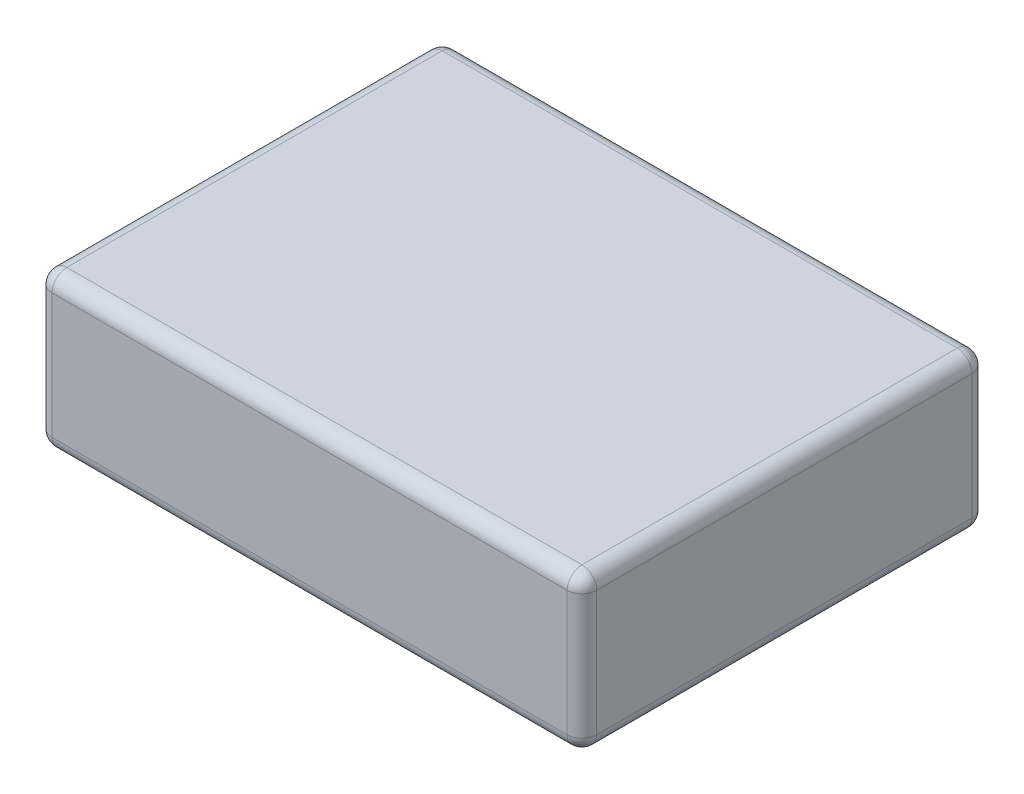
ISO-10303-21;
HEADER;
FILE_DESCRIPTION(('STEP AP214'),'2;1');
FILE_NAME('part.step','',(''),(''),'','','');
FILE_SCHEMA(('AUTOMOTIVE_DESIGN { 1 0 10303 214 1 1 1 1 }'));
ENDSEC;
DATA;
#1=APPLICATION_CONTEXT('core data for automotive mechanical design processes');
#2=APPLICATION_PROTOCOL_DEFINITION('international standard','automotive_design',2000,#1);
#3=PRODUCT_CONTEXT('',#1,'mechanical');
#4=PRODUCT('Part','Part','',(#3));
#5=PRODUCT_RELATED_PRODUCT_CATEGORY('part','',(#4));
#6=PRODUCT_DEFINITION_FORMATION('','',#4);
#7=PRODUCT_DEFINITION_CONTEXT('part definition',#1,'design');
#8=PRODUCT_DEFINITION('design','',#6,#7);
#9=PRODUCT_DEFINITION_SHAPE('','',#8);
#10=(LENGTH_UNIT() NAMED_UNIT(*) SI_UNIT(.MILLI.,.METRE.));
#11=(NAMED_UNIT(*) PLANE_ANGLE_UNIT() SI_UNIT($,.RADIAN.));
#12=(NAMED_UNIT(*) SI_UNIT($,.STERADIAN.) SOLID_ANGLE_UNIT());
#13=UNCERTAINTY_MEASURE_WITH_UNIT(LENGTH_MEASURE(1.E-05),#10,'distance_accuracy_value','');
#14=(GEOMETRIC_REPRESENTATION_CONTEXT(3) GLOBAL_UNCERTAINTY_ASSIGNED_CONTEXT((#13)) GLOBAL_UNIT_ASSIGNED_CONTEXT((#10,
#11,#12)) REPRESENTATION_CONTEXT('',''));
#15=CARTESIAN_POINT('',(0.,0.,0.));
#16=DIRECTION('',(0.,0.,1.));
#17=DIRECTION('',(1.,0.,0.));
#18=AXIS2_PLACEMENT_3D('',#15,#16,#17);
#19=CARTESIAN_POINT('',(0.,26.67,0.));
#20=DIRECTION('',(1.,0.,0.));
#21=DIRECTION('',(0.,0.,-1.));
#22=AXIS2_PLACEMENT_3D('',#19,#20,#21);
#23=PLANE('',#22);
#24=DIRECTION('',(0.,-1.,0.));
#25=VECTOR('',#24,1.);
#26=CARTESIAN_POINT('',(0.,26.67,-67.31));
#27=LINE('',#26,#25);
#28=CARTESIAN_POINT('',(0.,24.13,-67.31));
#29=VERTEX_POINT('',#28);
#30=CARTESIAN_POINT('',(0.,2.54,-67.31));
#31=VERTEX_POINT('',#30);
#32=EDGE_CURVE('E161',#29,#31,#27,.T.);
#33=ORIENTED_EDGE('',*,*,#32,.T.);
#34=DIRECTION('',(0.,0.,1.));
#35=VECTOR('',#34,1.);
#36=CARTESIAN_POINT('',(0.,2.54,0.));
#37=LINE('',#36,#35);
#38=CARTESIAN_POINT('',(0.,2.54,-2.54));
#39=VERTEX_POINT('',#38);
#40=EDGE_CURVE('E210',#31,#39,#37,.T.);
#41=ORIENTED_EDGE('',*,*,#40,.T.);
#42=DIRECTION('',(0.,-1.,0.));
#43=VECTOR('',#42,1.);
#44=CARTESIAN_POINT('',(0.,26.67,-2.54));
#45=LINE('',#44,#43);
#46=CARTESIAN_POINT('',(0.,24.13,-2.54));
#47=VERTEX_POINT('',#46);
#48=EDGE_CURVE('E205',#39,#47,#45,.F.);
#49=ORIENTED_EDGE('',*,*,#48,.T.);
#50=DIRECTION('',(0.,0.,1.));
#51=VECTOR('',#50,1.);
#52=CARTESIAN_POINT('',(0.,24.13,0.));
#53=LINE('',#52,#51);
#54=EDGE_CURVE('E202',#47,#29,#53,.F.);
#55=ORIENTED_EDGE('',*,*,#54,.T.);
#56=EDGE_LOOP('',(#33,#41,#49,#55));
#57=FACE_BOUND('',#56,.T.);
#58=ADVANCED_FACE('F38',(#57),#23,.F.);
#59=CARTESIAN_POINT('',(0.,26.67,0.));
#60=DIRECTION('',(0.,0.,-1.));
#61=DIRECTION('',(-1.,0.,0.));
#62=AXIS2_PLACEMENT_3D('',#59,#60,#61);
#63=PLANE('',#62);
#64=DIRECTION('',(0.,-1.,0.));
#65=VECTOR('',#64,1.);
#66=CARTESIAN_POINT('',(2.54,26.67,0.));
#67=LINE('',#66,#65);
#68=CARTESIAN_POINT('',(2.54,24.13,0.));
#69=VERTEX_POINT('',#68);
#70=CARTESIAN_POINT('',(2.54,2.54,0.));
#71=VERTEX_POINT('',#70);
#72=EDGE_CURVE('E217',#69,#71,#67,.T.);
#73=ORIENTED_EDGE('',*,*,#72,.T.);
#74=DIRECTION('',(1.,0.,0.));
#75=VECTOR('',#74,1.);
#76=CARTESIAN_POINT('',(93.98,2.54,0.));
#77=LINE('',#76,#75);
#78=CARTESIAN_POINT('',(91.44,2.54,0.));
#79=VERTEX_POINT('',#78);
#80=EDGE_CURVE('E220',#71,#79,#77,.T.);
#81=ORIENTED_EDGE('',*,*,#80,.T.);
#82=DIRECTION('',(0.,-1.,0.));
#83=VECTOR('',#82,1.);
#84=CARTESIAN_POINT('',(91.44,26.67,0.));
#85=LINE('',#84,#83);
#86=CARTESIAN_POINT('',(91.44,24.13,0.));
#87=VERTEX_POINT('',#86);
#88=EDGE_CURVE('E215',#79,#87,#85,.F.);
#89=ORIENTED_EDGE('',*,*,#88,.T.);
#90=DIRECTION('',(1.,0.,0.));
#91=VECTOR('',#90,1.);
#92=CARTESIAN_POINT('',(0.,24.13,0.));
#93=LINE('',#92,#91);
#94=EDGE_CURVE('E213',#87,#69,#93,.F.);
#95=ORIENTED_EDGE('',*,*,#94,.T.);
#96=EDGE_LOOP('',(#73,#81,#89,#95));
#97=FACE_BOUND('',#96,.T.);
#98=ADVANCED_FACE('F345',(#97),#63,.F.);
#99=CARTESIAN_POINT('',(93.98,26.67,0.));
#100=DIRECTION('',(-1.,0.,0.));
#101=DIRECTION('',(0.,0.,1.));
#102=AXIS2_PLACEMENT_3D('',#99,#100,#101);
#103=PLANE('',#102);
#104=DIRECTION('',(0.,-1.,0.));
#105=VECTOR('',#104,1.);
#106=CARTESIAN_POINT('',(93.98,26.67,-2.54));
#107=LINE('',#106,#105);
#108=CARTESIAN_POINT('',(93.98,24.13,-2.54));
#109=VERTEX_POINT('',#108);
#110=CARTESIAN_POINT('',(93.98,2.54,-2.54));
#111=VERTEX_POINT('',#110);
#112=EDGE_CURVE('E193',#109,#111,#107,.T.);
#113=ORIENTED_EDGE('',*,*,#112,.T.);
#114=DIRECTION('',(0.,0.,-1.));
#115=VECTOR('',#114,1.);
#116=CARTESIAN_POINT('',(93.98,2.54,-69.85));
#117=LINE('',#116,#115);
#118=CARTESIAN_POINT('',(93.98,2.54,-67.31));
#119=VERTEX_POINT('',#118);
#120=EDGE_CURVE('E199',#111,#119,#117,.T.);
#121=ORIENTED_EDGE('',*,*,#120,.T.);
#122=DIRECTION('',(0.,-1.,0.));
#123=VECTOR('',#122,1.);
#124=CARTESIAN_POINT('',(93.98,26.67,-67.31));
#125=LINE('',#124,#123);
#126=CARTESIAN_POINT('',(93.98,24.13,-67.31));
#127=VERTEX_POINT('',#126);
#128=EDGE_CURVE('E195',#119,#127,#125,.F.);
#129=ORIENTED_EDGE('',*,*,#128,.T.);
#130=DIRECTION('',(0.,0.,-1.));
#131=VECTOR('',#130,1.);
#132=CARTESIAN_POINT('',(93.98,24.13,0.));
#133=LINE('',#132,#131);
#134=EDGE_CURVE('E190',#127,#109,#133,.F.);
#135=ORIENTED_EDGE('',*,*,#134,.T.);
#136=EDGE_LOOP('',(#113,#121,#129,#135));
#137=FACE_BOUND('',#136,.T.);
#138=ADVANCED_FACE('F336',(#137),#103,.F.);
#139=CARTESIAN_POINT('',(0.,26.67,-69.85));
#140=DIRECTION('',(0.,0.,1.));
#141=DIRECTION('',(1.,0.,0.));
#142=AXIS2_PLACEMENT_3D('',#139,#140,#141);
#143=PLANE('',#142);
#144=DIRECTION('',(0.,-1.,0.));
#145=VECTOR('',#144,1.);
#146=CARTESIAN_POINT('',(91.44,26.67,-69.85));
#147=LINE('',#146,#145);
#148=CARTESIAN_POINT('',(91.44,24.13,-69.85));
#149=VERTEX_POINT('',#148);
#150=CARTESIAN_POINT('',(91.44,2.54,-69.85));
#151=VERTEX_POINT('',#150);
#152=EDGE_CURVE('E153',#149,#151,#147,.T.);
#153=ORIENTED_EDGE('',*,*,#152,.T.);
#154=DIRECTION('',(-1.,0.,0.));
#155=VECTOR('',#154,1.);
#156=CARTESIAN_POINT('',(0.,2.54,-69.85));
#157=LINE('',#156,#155);
#158=CARTESIAN_POINT('',(2.54,2.54,-69.85));
#159=VERTEX_POINT('',#158);
#160=EDGE_CURVE('E148',#151,#159,#157,.T.);
#161=ORIENTED_EDGE('',*,*,#160,.T.);
#162=DIRECTION('',(0.,-1.,0.));
#163=VECTOR('',#162,1.);
#164=CARTESIAN_POINT('',(2.54,26.67,-69.85));
#165=LINE('',#164,#163);
#166=CARTESIAN_POINT('',(2.54,24.13,-69.85));
#167=VERTEX_POINT('',#166);
#168=EDGE_CURVE('E140',#159,#167,#165,.F.);
#169=ORIENTED_EDGE('',*,*,#168,.T.);
#170=DIRECTION('',(-1.,0.,0.));
#171=VECTOR('',#170,1.);
#172=CARTESIAN_POINT('',(0.,24.13,-69.85));
#173=LINE('',#172,#171);
#174=EDGE_CURVE('E145',#167,#149,#173,.F.);
#175=ORIENTED_EDGE('',*,*,#174,.T.);
#176=EDGE_LOOP('',(#153,#161,#169,#175));
#177=FACE_BOUND('',#176,.T.);
#178=ADVANCED_FACE('F143',(#177),#143,.F.);
#179=CARTESIAN_POINT('',(0.,26.67,0.));
#180=DIRECTION('',(0.,-1.,0.));
#181=DIRECTION('',(0.,0.,-1.));
#182=AXIS2_PLACEMENT_3D('',#179,#180,#181);
#183=PLANE('',#182);
#184=DIRECTION('',(0.,0.,-1.));
#185=VECTOR('',#184,1.);
#186=CARTESIAN_POINT('',(91.44,26.67,0.));
#187=LINE('',#186,#185);
#188=CARTESIAN_POINT('',(91.44,26.67,-2.54));
#189=VERTEX_POINT('',#188);
#190=CARTESIAN_POINT('',(91.44,26.67,-67.31));
#191=VERTEX_POINT('',#190);
#192=EDGE_CURVE('E48',#189,#191,#187,.T.);
#193=ORIENTED_EDGE('',*,*,#192,.T.);
#194=DIRECTION('',(-1.,0.,0.));
#195=VECTOR('',#194,1.);
#196=CARTESIAN_POINT('',(0.,26.67,-67.31));
#197=LINE('',#196,#195);
#198=CARTESIAN_POINT('',(2.54,26.67,-67.31));
#199=VERTEX_POINT('',#198);
#200=EDGE_CURVE('E11',#191,#199,#197,.T.);
#201=ORIENTED_EDGE('',*,*,#200,.T.);
#202=DIRECTION('',(0.,0.,1.));
#203=VECTOR('',#202,1.);
#204=CARTESIAN_POINT('',(2.54,26.67,0.));
#205=LINE('',#204,#203);
#206=CARTESIAN_POINT('',(2.54,26.67,-2.54));
#207=VERTEX_POINT('',#206);
#208=EDGE_CURVE('E234',#199,#207,#205,.T.);
#209=ORIENTED_EDGE('',*,*,#208,.T.);
#210=DIRECTION('',(1.,0.,0.));
#211=VECTOR('',#210,1.);
#212=CARTESIAN_POINT('',(0.,26.67,-2.54));
#213=LINE('',#212,#211);
#214=EDGE_CURVE('E62',#207,#189,#213,.T.);
#215=ORIENTED_EDGE('',*,*,#214,.T.);
#216=EDGE_LOOP('',(#193,#201,#209,#215));
#217=FACE_BOUND('',#216,.T.);
#218=ADVANCED_FACE('F358',(#217),#183,.F.);
#219=CARTESIAN_POINT('',(0.,0.,0.));
#220=DIRECTION('',(0.,-1.,0.));
#221=DIRECTION('',(0.,0.,-1.));
#222=AXIS2_PLACEMENT_3D('',#219,#220,#221);
#223=PLANE('',#222);
#224=DIRECTION('',(0.,0.,-1.));
#225=VECTOR('',#224,1.);
#226=CARTESIAN_POINT('',(91.44,0.,0.));
#227=LINE('',#226,#225);
#228=CARTESIAN_POINT('',(91.44,0.,-67.31));
#229=VERTEX_POINT('',#228);
#230=CARTESIAN_POINT('',(91.44,0.,-2.54));
#231=VERTEX_POINT('',#230);
#232=EDGE_CURVE('E227',#229,#231,#227,.F.);
#233=ORIENTED_EDGE('',*,*,#232,.T.);
#234=DIRECTION('',(1.,0.,0.));
#235=VECTOR('',#234,1.);
#236=CARTESIAN_POINT('',(0.,0.,-2.54));
#237=LINE('',#236,#235);
#238=CARTESIAN_POINT('',(2.54,0.,-2.54));
#239=VERTEX_POINT('',#238);
#240=EDGE_CURVE('E230',#231,#239,#237,.F.);
#241=ORIENTED_EDGE('',*,*,#240,.T.);
#242=DIRECTION('',(0.,0.,1.));
#243=VECTOR('',#242,1.);
#244=CARTESIAN_POINT('',(2.54,0.,-69.85));
#245=LINE('',#244,#243);
#246=CARTESIAN_POINT('',(2.54,0.,-67.31));
#247=VERTEX_POINT('',#246);
#248=EDGE_CURVE('E222',#239,#247,#245,.F.);
#249=ORIENTED_EDGE('',*,*,#248,.T.);
#250=DIRECTION('',(-1.,0.,0.));
#251=VECTOR('',#250,1.);
#252=CARTESIAN_POINT('',(93.98,0.,-67.31));
#253=LINE('',#252,#251);
#254=EDGE_CURVE('E225',#247,#229,#253,.F.);
#255=ORIENTED_EDGE('',*,*,#254,.T.);
#256=EDGE_LOOP('',(#233,#241,#249,#255));
#257=FACE_BOUND('',#256,.T.);
#258=ADVANCED_FACE('F318',(#257),#223,.T.);
#259=CARTESIAN_POINT('',(2.54,26.67,-2.54));
#260=DIRECTION('',(0.,-1.,0.));
#261=DIRECTION('',(0.,0.,-1.));
#262=AXIS2_PLACEMENT_3D('',#259,#260,#261);
#263=CYLINDRICAL_SURFACE('',#262,2.54);
#264=CARTESIAN_POINT('',(2.54,24.13,-2.54));
#265=DIRECTION('',(0.,1.,0.));
#266=DIRECTION('',(0.,0.,1.));
#267=AXIS2_PLACEMENT_3D('',#264,#265,#266);
#268=CIRCLE('',#267,2.54);
#269=EDGE_CURVE('E42',#47,#69,#268,.T.);
#270=ORIENTED_EDGE('',*,*,#269,.F.);
#271=ORIENTED_EDGE('',*,*,#48,.F.);
#272=CARTESIAN_POINT('',(2.54,2.54,-2.54));
#273=DIRECTION('',(0.,-1.,0.));
#274=DIRECTION('',(0.,0.,-1.));
#275=AXIS2_PLACEMENT_3D('',#272,#273,#274);
#276=CIRCLE('',#275,2.54);
#277=EDGE_CURVE('E184',#71,#39,#276,.T.);
#278=ORIENTED_EDGE('',*,*,#277,.F.);
#279=ORIENTED_EDGE('',*,*,#72,.F.);
#280=EDGE_LOOP('',(#270,#271,#278,#279));
#281=FACE_BOUND('',#280,.T.);
#282=ADVANCED_FACE('F40',(#281),#263,.T.);
#283=CARTESIAN_POINT('',(2.54,24.13,-2.54));
#284=DIRECTION('',(0.,0.,1.));
#285=DIRECTION('',(1.,0.,0.));
#286=AXIS2_PLACEMENT_3D('',#283,#284,#285);
#287=SPHERICAL_SURFACE('',#286,2.54);
#288=CARTESIAN_POINT('',(2.54,24.13,-2.54));
#289=DIRECTION('',(0.,0.,1.));
#290=DIRECTION('',(1.,0.,0.));
#291=AXIS2_PLACEMENT_3D('',#288,#289,#290);
#292=CIRCLE('',#291,2.54);
#293=EDGE_CURVE('E295',#47,#207,#292,.F.);
#294=ORIENTED_EDGE('',*,*,#293,.F.);
#295=ORIENTED_EDGE('',*,*,#269,.T.);
#296=CARTESIAN_POINT('',(2.54,24.13,-2.54));
#297=DIRECTION('',(-1.,0.,0.));
#298=DIRECTION('',(0.,0.,1.));
#299=AXIS2_PLACEMENT_3D('',#296,#297,#298);
#300=CIRCLE('',#299,2.54);
#301=EDGE_CURVE('E299',#207,#69,#300,.F.);
#302=ORIENTED_EDGE('',*,*,#301,.F.);
#303=EDGE_LOOP('',(#294,#295,#302));
#304=FACE_BOUND('',#303,.T.);
#305=ADVANCED_FACE('F352',(#304),#287,.T.);
#306=CARTESIAN_POINT('',(2.54,2.54,-2.54));
#307=DIRECTION('',(0.,0.,1.));
#308=DIRECTION('',(1.,0.,0.));
#309=AXIS2_PLACEMENT_3D('',#306,#307,#308);
#310=SPHERICAL_SURFACE('',#309,2.54);
#311=CARTESIAN_POINT('',(2.54,2.54,-2.54));
#312=DIRECTION('',(-1.,0.,0.));
#313=DIRECTION('',(0.,0.,1.));
#314=AXIS2_PLACEMENT_3D('',#311,#312,#313);
#315=CIRCLE('',#314,2.54);
#316=EDGE_CURVE('E287',#71,#239,#315,.F.);
#317=ORIENTED_EDGE('',*,*,#316,.F.);
#318=ORIENTED_EDGE('',*,*,#277,.T.);
#319=CARTESIAN_POINT('',(2.54,2.54,-2.54));
#320=DIRECTION('',(0.,0.,1.));
#321=DIRECTION('',(1.,0.,0.));
#322=AXIS2_PLACEMENT_3D('',#319,#320,#321);
#323=CIRCLE('',#322,2.54);
#324=EDGE_CURVE('E291',#239,#39,#323,.F.);
#325=ORIENTED_EDGE('',*,*,#324,.F.);
#326=EDGE_LOOP('',(#317,#318,#325));
#327=FACE_BOUND('',#326,.T.);
#328=ADVANCED_FACE('F308',(#327),#310,.T.);
#329=CARTESIAN_POINT('',(0.,24.13,-2.54));
#330=DIRECTION('',(1.,0.,0.));
#331=DIRECTION('',(0.,0.,-1.));
#332=AXIS2_PLACEMENT_3D('',#329,#330,#331);
#333=CYLINDRICAL_SURFACE('',#332,2.54);
#334=ORIENTED_EDGE('',*,*,#301,.T.);
#335=ORIENTED_EDGE('',*,*,#94,.F.);
#336=CARTESIAN_POINT('',(91.44,24.13,-2.54));
#337=DIRECTION('',(1.,0.,0.));
#338=DIRECTION('',(0.,0.,-1.));
#339=AXIS2_PLACEMENT_3D('',#336,#337,#338);
#340=CIRCLE('',#339,2.54);
#341=EDGE_CURVE('E281',#189,#87,#340,.T.);
#342=ORIENTED_EDGE('',*,*,#341,.F.);
#343=ORIENTED_EDGE('',*,*,#214,.F.);
#344=EDGE_LOOP('',(#334,#335,#342,#343));
#345=FACE_BOUND('',#344,.T.);
#346=ADVANCED_FACE('F347',(#345),#333,.T.);
#347=CARTESIAN_POINT('',(2.54,24.13,0.));
#348=DIRECTION('',(0.,0.,1.));
#349=DIRECTION('',(1.,0.,0.));
#350=AXIS2_PLACEMENT_3D('',#347,#348,#349);
#351=CYLINDRICAL_SURFACE('',#350,2.54);
#352=ORIENTED_EDGE('',*,*,#293,.T.);
#353=ORIENTED_EDGE('',*,*,#208,.F.);
#354=CARTESIAN_POINT('',(2.54,24.13,-67.31));
#355=DIRECTION('',(0.,0.,-1.));
#356=DIRECTION('',(-1.,0.,0.));
#357=AXIS2_PLACEMENT_3D('',#354,#355,#356);
#358=CIRCLE('',#357,2.54);
#359=EDGE_CURVE('E165',#29,#199,#358,.T.);
#360=ORIENTED_EDGE('',*,*,#359,.F.);
#361=ORIENTED_EDGE('',*,*,#54,.F.);
#362=EDGE_LOOP('',(#352,#353,#360,#361));
#363=FACE_BOUND('',#362,.T.);
#364=ADVANCED_FACE('F357',(#363),#351,.T.);
#365=CARTESIAN_POINT('',(2.54,26.67,-67.31));
#366=DIRECTION('',(0.,-1.,0.));
#367=DIRECTION('',(0.,0.,-1.));
#368=AXIS2_PLACEMENT_3D('',#365,#366,#367);
#369=CYLINDRICAL_SURFACE('',#368,2.54);
#370=CARTESIAN_POINT('',(2.54,2.54,-67.31));
#371=DIRECTION('',(0.,-1.,0.));
#372=DIRECTION('',(0.,0.,-1.));
#373=AXIS2_PLACEMENT_3D('',#370,#371,#372);
#374=CIRCLE('',#373,2.54);
#375=EDGE_CURVE('E166',#31,#159,#374,.T.);
#376=ORIENTED_EDGE('',*,*,#375,.F.);
#377=ORIENTED_EDGE('',*,*,#32,.F.);
#378=CARTESIAN_POINT('',(2.54,24.13,-67.31));
#379=DIRECTION('',(0.,1.,0.));
#380=DIRECTION('',(0.,0.,1.));
#381=AXIS2_PLACEMENT_3D('',#378,#379,#380);
#382=CIRCLE('',#381,2.54);
#383=EDGE_CURVE('E157',#167,#29,#382,.T.);
#384=ORIENTED_EDGE('',*,*,#383,.F.);
#385=ORIENTED_EDGE('',*,*,#168,.F.);
#386=EDGE_LOOP('',(#376,#377,#384,#385));
#387=FACE_BOUND('',#386,.T.);
#388=ADVANCED_FACE('F159',(#387),#369,.T.);
#389=CARTESIAN_POINT('',(2.54,2.54,0.));
#390=DIRECTION('',(0.,0.,-1.));
#391=DIRECTION('',(-1.,0.,0.));
#392=AXIS2_PLACEMENT_3D('',#389,#390,#391);
#393=CYLINDRICAL_SURFACE('',#392,2.54);
#394=ORIENTED_EDGE('',*,*,#324,.T.);
#395=ORIENTED_EDGE('',*,*,#40,.F.);
#396=CARTESIAN_POINT('',(2.54,2.54,-67.31));
#397=DIRECTION('',(0.,0.,-1.));
#398=DIRECTION('',(-1.,0.,0.));
#399=AXIS2_PLACEMENT_3D('',#396,#397,#398);
#400=CIRCLE('',#399,2.54);
#401=EDGE_CURVE('E275',#247,#31,#400,.T.);
#402=ORIENTED_EDGE('',*,*,#401,.F.);
#403=ORIENTED_EDGE('',*,*,#248,.F.);
#404=EDGE_LOOP('',(#394,#395,#402,#403));
#405=FACE_BOUND('',#404,.T.);
#406=ADVANCED_FACE('F314',(#405),#393,.T.);
#407=CARTESIAN_POINT('',(0.,2.54,-2.54));
#408=DIRECTION('',(-1.,0.,0.));
#409=DIRECTION('',(0.,0.,1.));
#410=AXIS2_PLACEMENT_3D('',#407,#408,#409);
#411=CYLINDRICAL_SURFACE('',#410,2.54);
#412=ORIENTED_EDGE('',*,*,#316,.T.);
#413=ORIENTED_EDGE('',*,*,#240,.F.);
#414=CARTESIAN_POINT('',(91.44,2.54,-2.54));
#415=DIRECTION('',(1.,0.,0.));
#416=DIRECTION('',(0.,0.,-1.));
#417=AXIS2_PLACEMENT_3D('',#414,#415,#416);
#418=CIRCLE('',#417,2.54);
#419=EDGE_CURVE('E272',#79,#231,#418,.T.);
#420=ORIENTED_EDGE('',*,*,#419,.F.);
#421=ORIENTED_EDGE('',*,*,#80,.F.);
#422=EDGE_LOOP('',(#412,#413,#420,#421));
#423=FACE_BOUND('',#422,.T.);
#424=ADVANCED_FACE('F324',(#423),#411,.T.);
#425=CARTESIAN_POINT('',(91.44,26.67,-2.54));
#426=DIRECTION('',(0.,-1.,0.));
#427=DIRECTION('',(0.,0.,-1.));
#428=AXIS2_PLACEMENT_3D('',#425,#426,#427);
#429=CYLINDRICAL_SURFACE('',#428,2.54);
#430=CARTESIAN_POINT('',(91.44,24.13,-2.54));
#431=DIRECTION('',(0.,1.,0.));
#432=DIRECTION('',(0.,0.,1.));
#433=AXIS2_PLACEMENT_3D('',#430,#431,#432);
#434=CIRCLE('',#433,2.54);
#435=EDGE_CURVE('E284',#87,#109,#434,.T.);
#436=ORIENTED_EDGE('',*,*,#435,.F.);
#437=ORIENTED_EDGE('',*,*,#88,.F.);
#438=CARTESIAN_POINT('',(91.44,2.54,-2.54));
#439=DIRECTION('',(0.,-1.,0.));
#440=DIRECTION('',(0.,0.,-1.));
#441=AXIS2_PLACEMENT_3D('',#438,#439,#440);
#442=CIRCLE('',#441,2.54);
#443=EDGE_CURVE('E269',#111,#79,#442,.T.);
#444=ORIENTED_EDGE('',*,*,#443,.F.);
#445=ORIENTED_EDGE('',*,*,#112,.F.);
#446=EDGE_LOOP('',(#436,#437,#444,#445));
#447=FACE_BOUND('',#446,.T.);
#448=ADVANCED_FACE('F342',(#447),#429,.T.);
#449=CARTESIAN_POINT('',(91.44,24.13,-2.54));
#450=DIRECTION('',(0.,0.,1.));
#451=DIRECTION('',(1.,0.,0.));
#452=AXIS2_PLACEMENT_3D('',#449,#450,#451);
#453=SPHERICAL_SURFACE('',#452,2.54);
#454=ORIENTED_EDGE('',*,*,#341,.T.);
#455=ORIENTED_EDGE('',*,*,#435,.T.);
#456=CARTESIAN_POINT('',(91.44,24.13,-2.54));
#457=DIRECTION('',(0.,0.,1.));
#458=DIRECTION('',(1.,0.,0.));
#459=AXIS2_PLACEMENT_3D('',#456,#457,#458);
#460=CIRCLE('',#459,2.54);
#461=EDGE_CURVE('E172',#189,#109,#460,.F.);
#462=ORIENTED_EDGE('',*,*,#461,.F.);
#463=EDGE_LOOP('',(#454,#455,#462));
#464=FACE_BOUND('',#463,.T.);
#465=ADVANCED_FACE('F381',(#464),#453,.T.);
#466=CARTESIAN_POINT('',(2.54,24.13,-67.31));
#467=DIRECTION('',(0.,0.,1.));
#468=DIRECTION('',(1.,0.,0.));
#469=AXIS2_PLACEMENT_3D('',#466,#467,#468);
#470=SPHERICAL_SURFACE('',#469,2.54);
#471=ORIENTED_EDGE('',*,*,#383,.T.);
#472=ORIENTED_EDGE('',*,*,#359,.T.);
#473=CARTESIAN_POINT('',(2.54,24.13,-67.31));
#474=DIRECTION('',(-1.,0.,0.));
#475=DIRECTION('',(0.,0.,1.));
#476=AXIS2_PLACEMENT_3D('',#473,#474,#475);
#477=CIRCLE('',#476,2.54);
#478=EDGE_CURVE('E168',#167,#199,#477,.F.);
#479=ORIENTED_EDGE('',*,*,#478,.F.);
#480=EDGE_LOOP('',(#471,#472,#479));
#481=FACE_BOUND('',#480,.T.);
#482=ADVANCED_FACE('F169',(#481),#470,.T.);
#483=CARTESIAN_POINT('',(2.54,2.54,-67.31));
#484=DIRECTION('',(0.,0.,1.));
#485=DIRECTION('',(1.,0.,0.));
#486=AXIS2_PLACEMENT_3D('',#483,#484,#485);
#487=SPHERICAL_SURFACE('',#486,2.54);
#488=ORIENTED_EDGE('',*,*,#401,.T.);
#489=ORIENTED_EDGE('',*,*,#375,.T.);
#490=CARTESIAN_POINT('',(2.54,2.54,-67.31));
#491=DIRECTION('',(-1.,0.,0.));
#492=DIRECTION('',(0.,0.,1.));
#493=AXIS2_PLACEMENT_3D('',#490,#491,#492);
#494=CIRCLE('',#493,2.54);
#495=EDGE_CURVE('E173',#247,#159,#494,.F.);
#496=ORIENTED_EDGE('',*,*,#495,.F.);
#497=EDGE_LOOP('',(#488,#489,#496));
#498=FACE_BOUND('',#497,.T.);
#499=ADVANCED_FACE('F373',(#498),#487,.T.);
#500=CARTESIAN_POINT('',(91.44,2.54,-2.54));
#501=DIRECTION('',(0.,0.,1.));
#502=DIRECTION('',(1.,0.,0.));
#503=AXIS2_PLACEMENT_3D('',#500,#501,#502);
#504=SPHERICAL_SURFACE('',#503,2.54);
#505=ORIENTED_EDGE('',*,*,#443,.T.);
#506=ORIENTED_EDGE('',*,*,#419,.T.);
#507=CARTESIAN_POINT('',(91.44,2.54,-2.54));
#508=DIRECTION('',(0.,0.,1.));
#509=DIRECTION('',(1.,0.,0.));
#510=AXIS2_PLACEMENT_3D('',#507,#508,#509);
#511=CIRCLE('',#510,2.54);
#512=EDGE_CURVE('E261',#111,#231,#511,.F.);
#513=ORIENTED_EDGE('',*,*,#512,.F.);
#514=EDGE_LOOP('',(#505,#506,#513));
#515=FACE_BOUND('',#514,.T.);
#516=ADVANCED_FACE('F327',(#515),#504,.T.);
#517=CARTESIAN_POINT('',(91.44,24.13,0.));
#518=DIRECTION('',(0.,0.,-1.));
#519=DIRECTION('',(-1.,0.,0.));
#520=AXIS2_PLACEMENT_3D('',#517,#518,#519);
#521=CYLINDRICAL_SURFACE('',#520,2.54);
#522=ORIENTED_EDGE('',*,*,#461,.T.);
#523=ORIENTED_EDGE('',*,*,#134,.F.);
#524=CARTESIAN_POINT('',(91.44,24.13,-67.31));
#525=DIRECTION('',(0.,0.,-1.));
#526=DIRECTION('',(-1.,0.,0.));
#527=AXIS2_PLACEMENT_3D('',#524,#525,#526);
#528=CIRCLE('',#527,2.54);
#529=EDGE_CURVE('E257',#191,#127,#528,.T.);
#530=ORIENTED_EDGE('',*,*,#529,.F.);
#531=ORIENTED_EDGE('',*,*,#192,.F.);
#532=EDGE_LOOP('',(#522,#523,#530,#531));
#533=FACE_BOUND('',#532,.T.);
#534=ADVANCED_FACE('F361',(#533),#521,.T.);
#535=CARTESIAN_POINT('',(0.,24.13,-67.31));
#536=DIRECTION('',(-1.,0.,0.));
#537=DIRECTION('',(0.,0.,1.));
#538=AXIS2_PLACEMENT_3D('',#535,#536,#537);
#539=CYLINDRICAL_SURFACE('',#538,2.54);
#540=ORIENTED_EDGE('',*,*,#478,.T.);
#541=ORIENTED_EDGE('',*,*,#200,.F.);
#542=CARTESIAN_POINT('',(91.44,24.13,-67.31));
#543=DIRECTION('',(1.,0.,0.));
#544=DIRECTION('',(0.,0.,-1.));
#545=AXIS2_PLACEMENT_3D('',#542,#543,#544);
#546=CIRCLE('',#545,2.54);
#547=EDGE_CURVE('E177',#149,#191,#546,.T.);
#548=ORIENTED_EDGE('',*,*,#547,.F.);
#549=ORIENTED_EDGE('',*,*,#174,.F.);
#550=EDGE_LOOP('',(#540,#541,#548,#549));
#551=FACE_BOUND('',#550,.T.);
#552=ADVANCED_FACE('F175',(#551),#539,.T.);
#553=CARTESIAN_POINT('',(0.,2.54,-67.31));
#554=DIRECTION('',(1.,0.,0.));
#555=DIRECTION('',(0.,0.,-1.));
#556=AXIS2_PLACEMENT_3D('',#553,#554,#555);
#557=CYLINDRICAL_SURFACE('',#556,2.54);
#558=ORIENTED_EDGE('',*,*,#495,.T.);
#559=ORIENTED_EDGE('',*,*,#160,.F.);
#560=CARTESIAN_POINT('',(91.44,2.54,-67.31));
#561=DIRECTION('',(1.,0.,0.));
#562=DIRECTION('',(0.,0.,-1.));
#563=AXIS2_PLACEMENT_3D('',#560,#561,#562);
#564=CIRCLE('',#563,2.54);
#565=EDGE_CURVE('E251',#229,#151,#564,.T.);
#566=ORIENTED_EDGE('',*,*,#565,.F.);
#567=ORIENTED_EDGE('',*,*,#254,.F.);
#568=EDGE_LOOP('',(#558,#559,#566,#567));
#569=FACE_BOUND('',#568,.T.);
#570=ADVANCED_FACE('F371',(#569),#557,.T.);
#571=CARTESIAN_POINT('',(91.44,2.54,0.));
#572=DIRECTION('',(0.,0.,1.));
#573=DIRECTION('',(1.,0.,0.));
#574=AXIS2_PLACEMENT_3D('',#571,#572,#573);
#575=CYLINDRICAL_SURFACE('',#574,2.54);
#576=ORIENTED_EDGE('',*,*,#512,.T.);
#577=ORIENTED_EDGE('',*,*,#232,.F.);
#578=CARTESIAN_POINT('',(91.44,2.54,-67.31));
#579=DIRECTION('',(0.,0.,-1.));
#580=DIRECTION('',(-1.,0.,0.));
#581=AXIS2_PLACEMENT_3D('',#578,#579,#580);
#582=CIRCLE('',#581,2.54);
#583=EDGE_CURVE('E247',#119,#229,#582,.T.);
#584=ORIENTED_EDGE('',*,*,#583,.F.);
#585=ORIENTED_EDGE('',*,*,#120,.F.);
#586=EDGE_LOOP('',(#576,#577,#584,#585));
#587=FACE_BOUND('',#586,.T.);
#588=ADVANCED_FACE('F331',(#587),#575,.T.);
#589=CARTESIAN_POINT('',(91.44,24.13,-67.31));
#590=DIRECTION('',(0.,0.,1.));
#591=DIRECTION('',(1.,0.,0.));
#592=AXIS2_PLACEMENT_3D('',#589,#590,#591);
#593=SPHERICAL_SURFACE('',#592,2.54);
#594=ORIENTED_EDGE('',*,*,#547,.T.);
#595=ORIENTED_EDGE('',*,*,#529,.T.);
#596=CARTESIAN_POINT('',(91.44,24.13,-67.31));
#597=DIRECTION('',(0.,1.,0.));
#598=DIRECTION('',(0.,0.,1.));
#599=AXIS2_PLACEMENT_3D('',#596,#597,#598);
#600=CIRCLE('',#599,2.54);
#601=EDGE_CURVE('E244',#149,#127,#600,.F.);
#602=ORIENTED_EDGE('',*,*,#601,.F.);
#603=EDGE_LOOP('',(#594,#595,#602));
#604=FACE_BOUND('',#603,.T.);
#605=ADVANCED_FACE('F363',(#604),#593,.T.);
#606=CARTESIAN_POINT('',(91.44,2.54,-67.31));
#607=DIRECTION('',(0.,0.,1.));
#608=DIRECTION('',(1.,0.,0.));
#609=AXIS2_PLACEMENT_3D('',#606,#607,#608);
#610=SPHERICAL_SURFACE('',#609,2.54);
#611=ORIENTED_EDGE('',*,*,#583,.T.);
#612=ORIENTED_EDGE('',*,*,#565,.T.);
#613=CARTESIAN_POINT('',(91.44,2.54,-67.31));
#614=DIRECTION('',(0.,-1.,0.));
#615=DIRECTION('',(0.,0.,-1.));
#616=AXIS2_PLACEMENT_3D('',#613,#614,#615);
#617=CIRCLE('',#616,2.54);
#618=EDGE_CURVE('E241',#119,#151,#617,.F.);
#619=ORIENTED_EDGE('',*,*,#618,.F.);
#620=EDGE_LOOP('',(#611,#612,#619));
#621=FACE_BOUND('',#620,.T.);
#622=ADVANCED_FACE('F369',(#621),#610,.T.);
#623=CARTESIAN_POINT('',(91.44,26.67,-67.31));
#624=DIRECTION('',(0.,-1.,0.));
#625=DIRECTION('',(0.,0.,-1.));
#626=AXIS2_PLACEMENT_3D('',#623,#624,#625);
#627=CYLINDRICAL_SURFACE('',#626,2.54);
#628=ORIENTED_EDGE('',*,*,#601,.T.);
#629=ORIENTED_EDGE('',*,*,#128,.F.);
#630=ORIENTED_EDGE('',*,*,#618,.T.);
#631=ORIENTED_EDGE('',*,*,#152,.F.);
#632=EDGE_LOOP('',(#628,#629,#630,#631));
#633=FACE_BOUND('',#632,.T.);
#634=ADVANCED_FACE('F366',(#633),#627,.T.);
#635=CLOSED_SHELL('',(#58,#98,#138,#178,#218,#258,#282,#305,#328,#346,#364,#388,#406,#424,#448,
#465,#482,#499,#516,#534,#552,#570,#588,#605,#622,#634));
#636=MANIFOLD_SOLID_BREP('B2',#635);
#637=ADVANCED_BREP_SHAPE_REPRESENTATION('',(#18,#636),#14);
#638=SHAPE_DEFINITION_REPRESENTATION(#9,#637);
ENDSEC;
END-ISO-10303-21;
